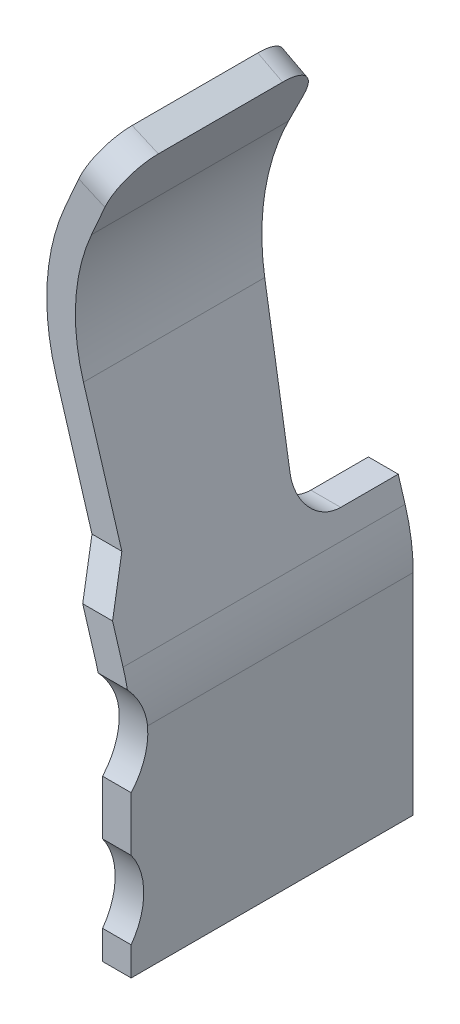
ISO-10303-21;
HEADER;
FILE_DESCRIPTION(('STEP AP214'),'2;1');
FILE_NAME('part.step','',(''),(''),'','','');
FILE_SCHEMA(('AUTOMOTIVE_DESIGN { 1 0 10303 214 1 1 1 1 }'));
ENDSEC;
DATA;
#1=APPLICATION_CONTEXT('core data for automotive mechanical design processes');
#2=APPLICATION_PROTOCOL_DEFINITION('international standard','automotive_design',2000,#1);
#3=PRODUCT_CONTEXT('',#1,'mechanical');
#4=PRODUCT('Part','Part','',(#3));
#5=PRODUCT_RELATED_PRODUCT_CATEGORY('part','',(#4));
#6=PRODUCT_DEFINITION_FORMATION('','',#4);
#7=PRODUCT_DEFINITION_CONTEXT('part definition',#1,'design');
#8=PRODUCT_DEFINITION('design','',#6,#7);
#9=PRODUCT_DEFINITION_SHAPE('','',#8);
#10=(LENGTH_UNIT() NAMED_UNIT(*) SI_UNIT(.MILLI.,.METRE.));
#11=(NAMED_UNIT(*) PLANE_ANGLE_UNIT() SI_UNIT($,.RADIAN.));
#12=(NAMED_UNIT(*) SI_UNIT($,.STERADIAN.) SOLID_ANGLE_UNIT());
#13=UNCERTAINTY_MEASURE_WITH_UNIT(LENGTH_MEASURE(1.E-05),#10,'distance_accuracy_value','');
#14=(GEOMETRIC_REPRESENTATION_CONTEXT(3) GLOBAL_UNCERTAINTY_ASSIGNED_CONTEXT((#13)) GLOBAL_UNIT_ASSIGNED_CONTEXT((#10,
#11,#12)) REPRESENTATION_CONTEXT('',''));
#15=CARTESIAN_POINT('',(0.,0.,0.));
#16=DIRECTION('',(0.,0.,1.));
#17=DIRECTION('',(1.,0.,0.));
#18=AXIS2_PLACEMENT_3D('',#15,#16,#17);
#19=CARTESIAN_POINT('',(-0.661555066818918,3.52330708865174,0.423604352914839));
#20=DIRECTION('',(0.915327071470027,-0.402711251685503,0.));
#21=DIRECTION('',(0.402711251685503,0.915327071470027,0.));
#22=AXIS2_PLACEMENT_3D('',#19,#20,#21);
#23=CYLINDRICAL_SURFACE('',#22,0.2);
#24=CARTESIAN_POINT('',(-0.661555066818916,3.52330708865174,0.423604352914839));
#25=DIRECTION('',(-0.915327071470028,0.4027112516855,0.));
#26=DIRECTION('',(0.4027112516855,0.915327071470028,0.));
#27=AXIS2_PLACEMENT_3D('',#24,#25,#26);
#28=CIRCLE('',#27,0.2);
#29=CARTESIAN_POINT('',(-0.661555066818916,3.52330708865174,0.623604352914839));
#30=VERTEX_POINT('',#29);
#31=CARTESIAN_POINT('',(-0.581012816481817,3.70637250294574,0.423604352914839));
#32=VERTEX_POINT('',#31);
#33=EDGE_CURVE('E411',#30,#32,#28,.T.);
#34=ORIENTED_EDGE('',*,*,#33,.F.);
#35=DIRECTION('',(-0.915327071470027,0.402711251685503,0.));
#36=VECTOR('',#35,1.);
#37=CARTESIAN_POINT('',(-25.2715059297135,14.3508073613119,0.623604352914805));
#38=LINE('',#37,#36);
#39=CARTESIAN_POINT('',(-0.524256006098414,3.46290040089891,0.623604352914839));
#40=VERTEX_POINT('',#39);
#41=EDGE_CURVE('E27',#40,#30,#38,.T.);
#42=ORIENTED_EDGE('',*,*,#41,.F.);
#43=CARTESIAN_POINT('',(-0.524256006098414,3.46290040089891,0.423604352914839));
#44=DIRECTION('',(0.915327071470028,-0.402711251685501,0.));
#45=DIRECTION('',(-0.402711251685501,-0.915327071470028,0.));
#46=AXIS2_PLACEMENT_3D('',#43,#44,#45);
#47=CIRCLE('',#46,0.2);
#48=CARTESIAN_POINT('',(-0.443713755761315,3.64596581519291,0.423604352914839));
#49=VERTEX_POINT('',#48);
#50=EDGE_CURVE('E578',#49,#40,#47,.T.);
#51=ORIENTED_EDGE('',*,*,#50,.F.);
#52=DIRECTION('',(0.915327071470027,-0.402711251685503,0.));
#53=VECTOR('',#52,1.);
#54=CARTESIAN_POINT('',(-0.581012816481817,3.70637250294574,0.423604352914839));
#55=LINE('',#54,#53);
#56=EDGE_CURVE('E378',#32,#49,#55,.T.);
#57=ORIENTED_EDGE('',*,*,#56,.F.);
#58=EDGE_LOOP('',(#34,#42,#51,#57));
#59=FACE_BOUND('',#58,.T.);
#60=ADVANCED_FACE('F16',(#59),#23,.T.);
#61=CARTESIAN_POINT('',(-0.683862741329987,3.53312166947706,-0.236832722369337));
#62=DIRECTION('',(-0.914255270392898,0.402239697454473,-0.0483789866630451));
#63=DIRECTION('',(-0.402711251685503,-0.915327071470027,0.));
#64=AXIS2_PLACEMENT_3D('',#61,#62,#63);
#65=CYLINDRICAL_SURFACE('',#64,0.2);
#66=CARTESIAN_POINT('',(-0.533059461954224,3.44289092405021,-0.427421697659668));
#67=CARTESIAN_POINT('',(-0.481982534807634,3.55898426375477,-0.441384710680955));
#68=CARTESIAN_POINT('',(-0.443713755761314,3.64596581519291,-0.356133634256614));
#69=CARTESIAN_POINT('',(-0.443713755761313,3.64596581519291,-0.228386927890316));
#70=(BOUNDED_CURVE() B_SPLINE_CURVE(3,(#66,#67,#68,#69),.UNSPECIFIED.,.F.,
.F.) B_SPLINE_CURVE_WITH_KNOTS((4,4),(6.17366415670651,7.85398163397443),
.UNSPECIFIED.) CURVE() GEOMETRIC_REPRESENTATION_ITEM() RATIONAL_B_SPLINE_CURVE((1.,
0.778229742533869,0.778229742533869,1.)) REPRESENTATION_ITEM(''));
#71=CARTESIAN_POINT('',(-0.533059461954224,3.44289092405021,-0.427421697659668));
#72=VERTEX_POINT('',#71);
#73=CARTESIAN_POINT('',(-0.443713755761313,3.64596581519291,-0.228386927890316));
#74=VERTEX_POINT('',#73);
#75=EDGE_CURVE('E377',#72,#74,#70,.T.);
#76=ORIENTED_EDGE('',*,*,#75,.F.);
#77=DIRECTION('',(0.914255270392898,-0.402239697454473,0.0483789866630451));
#78=VECTOR('',#77,1.);
#79=CARTESIAN_POINT('',(-25.871852655037,14.5910558161891,-1.76825633941021));
#80=LINE('',#79,#78);
#81=CARTESIAN_POINT('',(-0.670358522674724,3.50329761180303,-0.434687053017796));
#82=VERTEX_POINT('',#81);
#83=EDGE_CURVE('E11',#82,#72,#80,.T.);
#84=ORIENTED_EDGE('',*,*,#83,.F.);
#85=CARTESIAN_POINT('',(-0.581012816481815,3.70637250294574,-0.235652283248443));
#86=CARTESIAN_POINT('',(-0.581012816481817,3.70637250294574,-0.363398989614741));
#87=CARTESIAN_POINT('',(-0.619281595528137,3.6193909515076,-0.448650066039083));
#88=CARTESIAN_POINT('',(-0.670358522674724,3.50329761180303,-0.434687053017796));
#89=(BOUNDED_CURVE() B_SPLINE_CURVE(3,(#85,#86,#87,#88),.UNSPECIFIED.,.F.,
.F.) B_SPLINE_CURVE_WITH_KNOTS((4,4),(4.71238898038476,6.39270645765268),
.UNSPECIFIED.) CURVE() GEOMETRIC_REPRESENTATION_ITEM() RATIONAL_B_SPLINE_CURVE((1.,
0.77822974253387,0.77822974253387,1.)) REPRESENTATION_ITEM(''));
#90=CARTESIAN_POINT('',(-0.581012816481815,3.70637250294574,-0.235652283248443));
#91=VERTEX_POINT('',#90);
#92=EDGE_CURVE('E389',#91,#82,#89,.T.);
#93=ORIENTED_EDGE('',*,*,#92,.F.);
#94=DIRECTION('',(-0.914255270392898,0.402239697454473,-0.0483789866630451));
#95=VECTOR('',#94,1.);
#96=CARTESIAN_POINT('',(-0.603320490992886,3.71618708377106,-0.236832722369337));
#97=LINE('',#96,#95);
#98=EDGE_CURVE('E410',#74,#91,#97,.T.);
#99=ORIENTED_EDGE('',*,*,#98,.F.);
#100=EDGE_LOOP('',(#76,#84,#93,#99));
#101=FACE_BOUND('',#100,.T.);
#102=ADVANCED_FACE('F495',(#101),#65,.T.);
#103=CARTESIAN_POINT('',(-30.73,1.65634067151207,-0.212546111318104));
#104=DIRECTION('',(0.,-1.,0.));
#105=DIRECTION('',(0.,0.,-1.));
#106=AXIS2_PLACEMENT_3D('',#103,#104,#105);
#107=PLANE('',#106);
#108=DIRECTION('',(0.,0.,-1.));
#109=VECTOR('',#108,1.);
#110=CARTESIAN_POINT('',(-0.505164921058459,1.65634067151207,-0.740000000000018));
#111=LINE('',#110,#109);
#112=CARTESIAN_POINT('',(-0.505164921058459,1.65634067151207,-0.438042305987952));
#113=VERTEX_POINT('',#112);
#114=CARTESIAN_POINT('',(-0.505164921058459,1.65634067151207,-0.740000000000018));
#115=VERTEX_POINT('',#114);
#116=EDGE_CURVE('E384',#113,#115,#111,.T.);
#117=ORIENTED_EDGE('',*,*,#116,.F.);
#118=DIRECTION('',(1.,0.,0.));
#119=VECTOR('',#118,1.);
#120=CARTESIAN_POINT('',(-0.348496590894434,1.65634067151207,-0.438042305987951));
#121=LINE('',#120,#119);
#122=CARTESIAN_POINT('',(-0.34849659089442,1.65634067151207,-0.438042305987951));
#123=VERTEX_POINT('',#122);
#124=EDGE_CURVE('E420',#113,#123,#121,.T.);
#125=ORIENTED_EDGE('',*,*,#124,.T.);
#126=DIRECTION('',(0.,0.,1.));
#127=VECTOR('',#126,1.);
#128=CARTESIAN_POINT('',(-0.34849659089442,1.65634067151207,-0.740000000000018));
#129=LINE('',#128,#127);
#130=CARTESIAN_POINT('',(-0.34849659089442,1.65634067151207,-0.740000000000018));
#131=VERTEX_POINT('',#130);
#132=EDGE_CURVE('E569',#131,#123,#129,.T.);
#133=ORIENTED_EDGE('',*,*,#132,.F.);
#134=DIRECTION('',(-1.,0.,0.));
#135=VECTOR('',#134,1.);
#136=CARTESIAN_POINT('',(-1.27,1.65634067151207,-0.740000000000019));
#137=LINE('',#136,#135);
#138=EDGE_CURVE('E405',#131,#115,#137,.T.);
#139=ORIENTED_EDGE('',*,*,#138,.T.);
#140=EDGE_LOOP('',(#117,#125,#133,#139));
#141=FACE_BOUND('',#140,.T.);
#142=ADVANCED_FACE('F501',(#141),#107,.F.);
#143=CARTESIAN_POINT('',(-30.73,3.70637250294571,-0.459111687165995));
#144=DIRECTION('',(0.,0.119413416546905,0.992844618230162));
#145=DIRECTION('',(1.,0.,0.));
#146=AXIS2_PLACEMENT_3D('',#143,#144,#145);
#147=PLANE('',#146);
#148=DIRECTION('',(-0.28674853992682,0.951150986717314,-0.11439875574724));
#149=VECTOR('',#148,1.);
#150=CARTESIAN_POINT('',(-0.330336045111497,1.59610175610151,-0.205300934614502));
#151=LINE('',#150,#149);
#152=CARTESIAN_POINT('',(-0.415991692566375,1.88022335482146,-0.239473382341919));
#153=VERTEX_POINT('',#152);
#154=CARTESIAN_POINT('',(-0.63658626409634,2.61194022573825,-0.327479914176621));
#155=VERTEX_POINT('',#154);
#156=EDGE_CURVE('E437',#153,#155,#151,.T.);
#157=ORIENTED_EDGE('',*,*,#156,.F.);
#158=DIRECTION('',(-1.,0.,0.));
#159=VECTOR('',#158,1.);
#160=CARTESIAN_POINT('',(-0.505164921058468,1.88022335482146,-0.23947338234192));
#161=LINE('',#160,#159);
#162=CARTESIAN_POINT('',(-0.572660022730412,1.88022335482146,-0.23947338234192));
#163=VERTEX_POINT('',#162);
#164=EDGE_CURVE('E310',#153,#163,#161,.T.);
#165=ORIENTED_EDGE('',*,*,#164,.T.);
#166=DIRECTION('',(0.286748539926818,-0.951150986717315,0.11439875574724));
#167=VECTOR('',#166,1.);
#168=CARTESIAN_POINT('',(-0.474122364888061,1.55337185451571,-0.200161637444145));
#169=LINE('',#168,#167);
#170=CARTESIAN_POINT('',(-0.780201760453783,2.56864369924933,-0.322272466749579));
#171=VERTEX_POINT('',#170);
#172=EDGE_CURVE('E450',#171,#163,#169,.T.);
#173=ORIENTED_EDGE('',*,*,#172,.F.);
#174=CARTESIAN_POINT('',(-0.731775753903917,3.36370167510267,-0.417897288102545));
#175=CARTESIAN_POINT('',(-0.843300794906729,3.11021511680704,-0.387409439934768));
#176=CARTESIAN_POINT('',(-0.860137394596042,2.83379189253285,-0.354162906673266));
#177=CARTESIAN_POINT('',(-0.780201760453783,2.56864369924933,-0.322272466749579));
#178=(BOUNDED_CURVE() B_SPLINE_CURVE(3,(#174,#175,#176,#177),.UNSPECIFIED.,.F.,
.F.) B_SPLINE_CURVE_WITH_KNOTS((4,4),(4.29791199977039,5.00519872138853),
.UNSPECIFIED.) CURVE() GEOMETRIC_REPRESENTATION_ITEM() RATIONAL_B_SPLINE_CURVE((1.,
0.958744787021091,0.958744787021091,1.)) REPRESENTATION_ITEM(''));
#179=CARTESIAN_POINT('',(-0.731775753903917,3.36370167510267,-0.417897288102545));
#180=VERTEX_POINT('',#179);
#181=EDGE_CURVE('E460',#180,#171,#178,.T.);
#182=ORIENTED_EDGE('',*,*,#181,.F.);
#183=DIRECTION('',(-0.400292818236851,-0.909830186054405,0.109428936813832));
#184=VECTOR('',#183,1.);
#185=CARTESIAN_POINT('',(-0.71766648991178,3.39577078475993,-0.421754368938234));
#186=LINE('',#185,#184);
#187=EDGE_CURVE('E395',#82,#180,#186,.T.);
#188=ORIENTED_EDGE('',*,*,#187,.F.);
#189=ORIENTED_EDGE('',*,*,#83,.T.);
#190=DIRECTION('',(0.400292818236852,0.909830186054405,-0.109428936813832));
#191=VECTOR('',#190,1.);
#192=CARTESIAN_POINT('',(-0.580049180344069,3.33608744850051,-0.414576013974332));
#193=LINE('',#192,#191);
#194=CARTESIAN_POINT('',(-0.594476693183414,3.30329498734983,-0.410631932744417));
#195=VERTEX_POINT('',#194);
#196=EDGE_CURVE('E373',#195,#72,#193,.T.);
#197=ORIENTED_EDGE('',*,*,#196,.F.);
#198=CARTESIAN_POINT('',(-0.63658626409634,2.61194022573825,-0.327479914176621));
#199=CARTESIAN_POINT('',(-0.706095511176566,2.84250387207174,-0.355210731501565));
#200=CARTESIAN_POINT('',(-0.691454989707598,3.08287189317973,-0.384120760424611));
#201=CARTESIAN_POINT('',(-0.594476693183414,3.30329498734983,-0.410631932744417));
#202=(BOUNDED_CURVE() B_SPLINE_CURVE(3,(#198,#199,#200,#201),.UNSPECIFIED.,.F.,
.F.) B_SPLINE_CURVE_WITH_KNOTS((4,4),(1.27798658579106,1.98527330740919),
.UNSPECIFIED.) CURVE() GEOMETRIC_REPRESENTATION_ITEM() RATIONAL_B_SPLINE_CURVE((1.,
0.958744787021091,0.958744787021091,1.)) REPRESENTATION_ITEM(''));
#203=EDGE_CURVE('E357',#155,#195,#202,.T.);
#204=ORIENTED_EDGE('',*,*,#203,.F.);
#205=EDGE_LOOP('',(#157,#165,#173,#182,#188,#189,#197,#204));
#206=FACE_BOUND('',#205,.T.);
#207=ADVANCED_FACE('F511',(#206),#147,.F.);
#208=CARTESIAN_POINT('',(-30.73,1.94413292378283,0.623604352914797));
#209=DIRECTION('',(0.,0.,-1.));
#210=DIRECTION('',(0.,-1.,0.));
#211=AXIS2_PLACEMENT_3D('',#208,#209,#210);
#212=PLANE('',#211);
#213=DIRECTION('',(-0.402711251685501,-0.915327071470028,0.));
#214=VECTOR('',#213,1.);
#215=CARTESIAN_POINT('',(-0.594476693183417,3.30329498734984,0.623604352914839));
#216=LINE('',#215,#214);
#217=CARTESIAN_POINT('',(-0.594476693183415,3.30329498734984,0.623604352914839));
#218=VERTEX_POINT('',#217);
#219=EDGE_CURVE('E388',#40,#218,#216,.T.);
#220=ORIENTED_EDGE('',*,*,#219,.F.);
#221=ORIENTED_EDGE('',*,*,#41,.T.);
#222=DIRECTION('',(0.4027112516855,0.915327071470028,0.));
#223=VECTOR('',#222,1.);
#224=CARTESIAN_POINT('',(-0.731775753903919,3.36370167510267,0.623604352914839));
#225=LINE('',#224,#223);
#226=CARTESIAN_POINT('',(-0.731775753903919,3.36370167510267,0.623604352914839));
#227=VERTEX_POINT('',#226);
#228=EDGE_CURVE('E427',#227,#30,#225,.T.);
#229=ORIENTED_EDGE('',*,*,#228,.F.);
#230=CARTESIAN_POINT('',(0.320850378286613,2.90058373566433,0.62360435291484));
#231=DIRECTION('',(0.,0.,-1.));
#232=DIRECTION('',(-1.,0.,0.));
#233=AXIS2_PLACEMENT_3D('',#230,#231,#232);
#234=CIRCLE('',#233,1.15);
#235=CARTESIAN_POINT('',(-0.780201760453785,2.56864369924933,0.623604352914839));
#236=VERTEX_POINT('',#235);
#237=EDGE_CURVE('E465',#236,#227,#234,.T.);
#238=ORIENTED_EDGE('',*,*,#237,.F.);
#239=DIRECTION('',(-0.288643509926088,0.957436642382956,0.));
#240=VECTOR('',#239,1.);
#241=CARTESIAN_POINT('',(-0.456178853974488,1.49385284836845,0.623604352914839));
#242=LINE('',#241,#240);
#243=CARTESIAN_POINT('',(-0.59192717993568,1.94413292378283,0.623604352914839));
#244=VERTEX_POINT('',#243);
#245=EDGE_CURVE('E548',#244,#236,#242,.T.);
#246=ORIENTED_EDGE('',*,*,#245,.F.);
#247=DIRECTION('',(1.,0.,0.));
#248=VECTOR('',#247,1.);
#249=CARTESIAN_POINT('',(-30.73,1.94413292378283,0.623604352914797));
#250=LINE('',#249,#248);
#251=CARTESIAN_POINT('',(-0.435258849771643,1.94413292378283,0.623604352914839));
#252=VERTEX_POINT('',#251);
#253=EDGE_CURVE('E403',#244,#252,#250,.T.);
#254=ORIENTED_EDGE('',*,*,#253,.T.);
#255=DIRECTION('',(0.28864350992609,-0.957436642382956,0.));
#256=VECTOR('',#255,1.);
#257=CARTESIAN_POINT('',(-0.312563357617044,1.53714937485737,0.623604352914839));
#258=LINE('',#257,#256);
#259=CARTESIAN_POINT('',(-0.636586264096342,2.61194022573825,0.623604352914839));
#260=VERTEX_POINT('',#259);
#261=EDGE_CURVE('E415',#260,#252,#258,.T.);
#262=ORIENTED_EDGE('',*,*,#261,.F.);
#263=CARTESIAN_POINT('',(0.320850378286613,2.90058373566433,0.62360435291484));
#264=DIRECTION('',(0.,0.,1.));
#265=DIRECTION('',(-1.,0.,0.));
#266=AXIS2_PLACEMENT_3D('',#263,#264,#265);
#267=CIRCLE('',#266,1.);
#268=EDGE_CURVE('E577',#218,#260,#267,.T.);
#269=ORIENTED_EDGE('',*,*,#268,.F.);
#270=EDGE_LOOP('',(#220,#221,#229,#238,#246,#254,#262,#269));
#271=FACE_BOUND('',#270,.T.);
#272=ADVANCED_FACE('F513',(#271),#212,.F.);
#273=CARTESIAN_POINT('',(-30.73,1.7003498353216,0.749999999999972));
#274=DIRECTION('',(0.,-0.460287319631494,-0.887770005906065));
#275=DIRECTION('',(0.,-0.887770005906065,0.460287319631494));
#276=AXIS2_PLACEMENT_3D('',#273,#274,#275);
#277=PLANE('',#276);
#278=DIRECTION('',(-1.,0.,0.));
#279=VECTOR('',#278,1.);
#280=CARTESIAN_POINT('',(-1.27,1.7196371362757,0.739999999999981));
#281=LINE('',#280,#279);
#282=CARTESIAN_POINT('',(-0.36757891232074,1.7196371362757,0.739999999999982));
#283=VERTEX_POINT('',#282);
#284=CARTESIAN_POINT('',(-0.524247242484777,1.7196371362757,0.739999999999982));
#285=VERTEX_POINT('',#284);
#286=EDGE_CURVE('E326',#283,#285,#281,.T.);
#287=ORIENTED_EDGE('',*,*,#286,.F.);
#288=DIRECTION('',(0.258541028225372,-0.857586072334425,0.444637678635293));
#289=VECTOR('',#288,1.);
#290=CARTESIAN_POINT('',(-0.493576561693567,2.13757401070795,0.523309818502748));
#291=LINE('',#290,#289);
#292=EDGE_CURVE('E412',#252,#283,#291,.T.);
#293=ORIENTED_EDGE('',*,*,#292,.F.);
#294=ORIENTED_EDGE('',*,*,#253,.F.);
#295=DIRECTION('',(-0.258541028225371,0.857586072334425,-0.444637678635293));
#296=VECTOR('',#295,1.);
#297=CARTESIAN_POINT('',(-0.639772638083798,2.10283732290249,0.541319952677684));
#298=LINE('',#297,#296);
#299=EDGE_CURVE('E383',#285,#244,#298,.T.);
#300=ORIENTED_EDGE('',*,*,#299,.F.);
#301=EDGE_LOOP('',(#287,#293,#294,#300));
#302=FACE_BOUND('',#301,.T.);
#303=ADVANCED_FACE('F651',(#302),#277,.F.);
#304=CARTESIAN_POINT('',(-1.27,1.24850586493128,0.739999999999981));
#305=DIRECTION('',(0.,0.,-1.));
#306=DIRECTION('',(0.,-1.,0.));
#307=AXIS2_PLACEMENT_3D('',#304,#305,#306);
#308=PLANE('',#307);
#309=DIRECTION('',(0.,-1.,0.));
#310=VECTOR('',#309,1.);
#311=CARTESIAN_POINT('',(-0.27,0.145965815192914,0.739999999999982));
#312=LINE('',#311,#310);
#313=CARTESIAN_POINT('',(-0.270000000000005,0.296740599868486,0.739999999999982));
#314=VERTEX_POINT('',#313);
#315=CARTESIAN_POINT('',(-0.27,0.145965815192914,0.739999999999982));
#316=VERTEX_POINT('',#315);
#317=EDGE_CURVE('E459',#314,#316,#312,.T.);
#318=ORIENTED_EDGE('',*,*,#317,.F.);
#319=DIRECTION('',(-1.,0.,0.));
#320=VECTOR('',#319,1.);
#321=CARTESIAN_POINT('',(-30.73,0.296740599868486,0.73999999999994));
#322=LINE('',#321,#320);
#323=CARTESIAN_POINT('',(-0.42,0.296740599868486,0.739999999999982));
#324=VERTEX_POINT('',#323);
#325=EDGE_CURVE('E347',#314,#324,#322,.T.);
#326=ORIENTED_EDGE('',*,*,#325,.T.);
#327=DIRECTION('',(0.,1.,0.));
#328=VECTOR('',#327,1.);
#329=CARTESIAN_POINT('',(-0.42,0.145965815192914,0.739999999999982));
#330=LINE('',#329,#328);
#331=CARTESIAN_POINT('',(-0.42,0.145965815192914,0.739999999999982));
#332=VERTEX_POINT('',#331);
#333=EDGE_CURVE('E372',#332,#324,#330,.T.);
#334=ORIENTED_EDGE('',*,*,#333,.F.);
#335=DIRECTION('',(-1.,0.,0.));
#336=VECTOR('',#335,1.);
#337=CARTESIAN_POINT('',(-0.42,0.145965815192914,0.739999999999982));
#338=LINE('',#337,#336);
#339=EDGE_CURVE('E341',#316,#332,#338,.T.);
#340=ORIENTED_EDGE('',*,*,#339,.F.);
#341=EDGE_LOOP('',(#318,#326,#334,#340));
#342=FACE_BOUND('',#341,.T.);
#343=ADVANCED_FACE('F649',(#342),#308,.F.);
#344=CARTESIAN_POINT('',(-1.27,1.24850586493128,-0.740000000000019));
#345=DIRECTION('',(0.,0.,-1.));
#346=DIRECTION('',(0.,-1.,0.));
#347=AXIS2_PLACEMENT_3D('',#344,#345,#346);
#348=PLANE('',#347);
#349=ORIENTED_EDGE('',*,*,#138,.F.);
#350=DIRECTION('',(0.28864350992609,-0.957436642382956,0.));
#351=VECTOR('',#350,1.);
#352=CARTESIAN_POINT('',(-0.312563357617042,1.53714937485737,-0.740000000000018));
#353=LINE('',#352,#351);
#354=CARTESIAN_POINT('',(-0.312563357617044,1.53714937485737,-0.740000000000018));
#355=VERTEX_POINT('',#354);
#356=EDGE_CURVE('E573',#131,#355,#353,.T.);
#357=ORIENTED_EDGE('',*,*,#356,.T.);
#358=CARTESIAN_POINT('',(-1.27,1.24850586493128,-0.740000000000019));
#359=DIRECTION('',(0.,0.,-1.));
#360=DIRECTION('',(-1.,0.,0.));
#361=AXIS2_PLACEMENT_3D('',#358,#359,#360);
#362=CIRCLE('',#361,1.);
#363=CARTESIAN_POINT('',(-0.27,1.24850586493128,-0.740000000000018));
#364=VERTEX_POINT('',#363);
#365=EDGE_CURVE('E572',#355,#364,#362,.T.);
#366=ORIENTED_EDGE('',*,*,#365,.T.);
#367=DIRECTION('',(0.,-1.,0.));
#368=VECTOR('',#367,1.);
#369=CARTESIAN_POINT('',(-0.27,0.145965815192914,-0.740000000000018));
#370=LINE('',#369,#368);
#371=CARTESIAN_POINT('',(-0.27,0.145965815192914,-0.740000000000018));
#372=VERTEX_POINT('',#371);
#373=EDGE_CURVE('E41',#364,#372,#370,.T.);
#374=ORIENTED_EDGE('',*,*,#373,.T.);
#375=DIRECTION('',(-1.,0.,0.));
#376=VECTOR('',#375,1.);
#377=CARTESIAN_POINT('',(-0.42,0.145965815192914,-0.740000000000018));
#378=LINE('',#377,#376);
#379=CARTESIAN_POINT('',(-0.42,0.145965815192914,-0.740000000000018));
#380=VERTEX_POINT('',#379);
#381=EDGE_CURVE('E339',#372,#380,#378,.T.);
#382=ORIENTED_EDGE('',*,*,#381,.T.);
#383=DIRECTION('',(0.,1.,0.));
#384=VECTOR('',#383,1.);
#385=CARTESIAN_POINT('',(-0.42,0.145965815192914,-0.740000000000018));
#386=LINE('',#385,#384);
#387=CARTESIAN_POINT('',(-0.42,1.24850586493128,-0.740000000000018));
#388=VERTEX_POINT('',#387);
#389=EDGE_CURVE('E301',#380,#388,#386,.T.);
#390=ORIENTED_EDGE('',*,*,#389,.T.);
#391=CARTESIAN_POINT('',(-1.27,1.24850586493128,-0.740000000000019));
#392=DIRECTION('',(0.,0.,1.));
#393=DIRECTION('',(-1.,0.,0.));
#394=AXIS2_PLACEMENT_3D('',#391,#392,#393);
#395=CIRCLE('',#394,0.85);
#396=CARTESIAN_POINT('',(-0.456178853974486,1.49385284836845,-0.740000000000018));
#397=VERTEX_POINT('',#396);
#398=EDGE_CURVE('E456',#388,#397,#395,.T.);
#399=ORIENTED_EDGE('',*,*,#398,.T.);
#400=DIRECTION('',(-0.288643509926088,0.957436642382956,0.));
#401=VECTOR('',#400,1.);
#402=CARTESIAN_POINT('',(-0.456178853974486,1.49385284836845,-0.740000000000018));
#403=LINE('',#402,#401);
#404=EDGE_CURVE('E379',#397,#115,#403,.T.);
#405=ORIENTED_EDGE('',*,*,#404,.T.);
#406=EDGE_LOOP('',(#349,#357,#366,#374,#382,#390,#399,#405));
#407=FACE_BOUND('',#406,.T.);
#408=ADVANCED_FACE('F640',(#407),#348,.T.);
#409=CARTESIAN_POINT('',(-0.27,0.145965815192914,-0.740000000000018));
#410=DIRECTION('',(-1.,0.,0.));
#411=DIRECTION('',(0.,0.,1.));
#412=AXIS2_PLACEMENT_3D('',#409,#410,#411);
#413=PLANE('',#412);
#414=DIRECTION('',(0.,0.,1.));
#415=VECTOR('',#414,1.);
#416=CARTESIAN_POINT('',(-0.27,1.24850586493128,-0.740000000000018));
#417=LINE('',#416,#415);
#418=CARTESIAN_POINT('',(-0.270000000000005,1.24850586493128,0.654029100989327));
#419=VERTEX_POINT('',#418);
#420=EDGE_CURVE('E529',#364,#419,#417,.T.);
#421=ORIENTED_EDGE('',*,*,#420,.T.);
#422=CARTESIAN_POINT('',(-0.270000000000005,1.21669179396546,0.995153761033099));
#423=DIRECTION('',(1.,0.,0.));
#424=DIRECTION('',(0.,0.,1.));
#425=AXIS2_PLACEMENT_3D('',#422,#423,#424);
#426=CIRCLE('',#425,0.342604974863759);
#427=CARTESIAN_POINT('',(-0.270000000000005,0.988055123608201,0.739999999999982));
#428=VERTEX_POINT('',#427);
#429=EDGE_CURVE('E261',#428,#419,#426,.T.);
#430=ORIENTED_EDGE('',*,*,#429,.F.);
#431=DIRECTION('',(0.,-1.,0.));
#432=VECTOR('',#431,1.);
#433=CARTESIAN_POINT('',(-0.27,0.145965815192914,0.739999999999982));
#434=LINE('',#433,#432);
#435=CARTESIAN_POINT('',(-0.270000000000005,0.703259400131467,0.739999999999982));
#436=VERTEX_POINT('',#435);
#437=EDGE_CURVE('E242',#428,#436,#434,.T.);
#438=ORIENTED_EDGE('',*,*,#437,.T.);
#439=CARTESIAN_POINT('',(-0.270000000000005,0.499999999999977,1.01942683457021));
#440=DIRECTION('',(1.,0.,0.));
#441=DIRECTION('',(0.,0.,1.));
#442=AXIS2_PLACEMENT_3D('',#439,#440,#441);
#443=CIRCLE('',#442,0.345533991988848);
#444=EDGE_CURVE('E351',#314,#436,#443,.T.);
#445=ORIENTED_EDGE('',*,*,#444,.F.);
#446=ORIENTED_EDGE('',*,*,#317,.T.);
#447=DIRECTION('',(0.,0.,1.));
#448=VECTOR('',#447,1.);
#449=CARTESIAN_POINT('',(-0.27,0.145965815192914,-0.740000000000018));
#450=LINE('',#449,#448);
#451=EDGE_CURVE('E302',#372,#316,#450,.T.);
#452=ORIENTED_EDGE('',*,*,#451,.F.);
#453=ORIENTED_EDGE('',*,*,#373,.F.);
#454=EDGE_LOOP('',(#421,#430,#438,#445,#446,#452,#453));
#455=FACE_BOUND('',#454,.T.);
#456=ADVANCED_FACE('F284',(#455),#413,.F.);
#457=CARTESIAN_POINT('',(-1.27,1.24850586493128,-0.740000000000019));
#458=DIRECTION('',(0.,0.,1.));
#459=DIRECTION('',(1.,0.,0.));
#460=AXIS2_PLACEMENT_3D('',#457,#458,#459);
#461=CYLINDRICAL_SURFACE('',#460,1.);
#462=CARTESIAN_POINT('',(-1.27,1.24850586493128,0.739999999999981));
#463=DIRECTION('',(0.,0.,-1.));
#464=DIRECTION('',(-1.,0.,0.));
#465=AXIS2_PLACEMENT_3D('',#462,#463,#464);
#466=CIRCLE('',#465,1.);
#467=CARTESIAN_POINT('',(-0.312563357617045,1.53714937485737,0.739999999999982));
#468=VERTEX_POINT('',#467);
#469=CARTESIAN_POINT('',(-0.289560881865275,1.44532846432271,0.739999999999982));
#470=VERTEX_POINT('',#469);
#471=EDGE_CURVE('E228',#468,#470,#466,.T.);
#472=ORIENTED_EDGE('',*,*,#471,.T.);
#473=CARTESIAN_POINT('',(-0.289560881865276,1.44532846432271,0.739999999999982));
#474=CARTESIAN_POINT('',(-0.288878682583164,1.4419302471742,0.73695469854553));
#475=CARTESIAN_POINT('',(-0.288202781491508,1.43847176034271,0.733975045899739));
#476=CARTESIAN_POINT('',(-0.286871440474027,1.43145643098173,0.728168909339999));
#477=CARTESIAN_POINT('',(-0.286215910683777,1.4279002110217,0.725341693611933));
#478=CARTESIAN_POINT('',(-0.284928311830287,1.42068928784964,0.719840380711266));
#479=CARTESIAN_POINT('',(-0.284296161720783,1.41703501951599,0.717165732805619));
#480=CARTESIAN_POINT('',(-0.283058427873437,1.40962817005629,0.711969336935426));
#481=CARTESIAN_POINT('',(-0.282452784478732,1.40587584366131,0.709447240161887));
#482=CARTESIAN_POINT('',(-0.281271228703156,1.39827302810716,0.704555749407427));
#483=CARTESIAN_POINT('',(-0.280695291111547,1.39442262647144,0.702186225502017));
#484=CARTESIAN_POINT('',(-0.279576382774034,1.38662388081515,0.697599649617423));
#485=CARTESIAN_POINT('',(-0.279033434183224,1.38267547342769,0.695382699975889));
#486=CARTESIAN_POINT('',(-0.27798380395006,1.37468096295907,0.691101059928249));
#487=CARTESIAN_POINT('',(-0.277477204261149,1.37063466501779,0.689036713287359));
#488=CARTESIAN_POINT('',(-0.276503648406026,1.36244473872741,0.68505995514894));
#489=CARTESIAN_POINT('',(-0.276036845603953,1.35830080604152,0.683148133100331));
#490=CARTESIAN_POINT('',(-0.275146148982741,1.34991442649092,0.679475891500464));
#491=CARTESIAN_POINT('',(-0.274722504928995,1.34567156354334,0.677716361222175));
#492=CARTESIAN_POINT('',(-0.273926471942081,1.33713872195234,0.67437603386879));
#493=CARTESIAN_POINT('',(-0.27355381064899,1.33284913740293,0.672794295796545));
#494=CARTESIAN_POINT('',(-0.272861361452102,1.32422362544513,0.669809238507272));
#495=CARTESIAN_POINT('',(-0.272541365850075,1.31988795555454,0.668405223722643));
#496=CARTESIAN_POINT('',(-0.271955855889899,1.31117101253282,0.665775382478383));
#497=CARTESIAN_POINT('',(-0.271690208575333,1.30678987892417,0.664549123358667));
#498=CARTESIAN_POINT('',(-0.271215006321554,1.29798278695432,0.662274523841798));
#499=CARTESIAN_POINT('',(-0.271005402039289,1.29355687160879,0.661226027233404));
#500=CARTESIAN_POINT('',(-0.270643887759249,1.28466100981404,0.659306657193431));
#501=CARTESIAN_POINT('',(-0.270492019451184,1.2801910339301,0.658435912321234));
#502=CARTESIAN_POINT('',(-0.27024760848128,1.27120787033449,0.656871822149803));
#503=CARTESIAN_POINT('',(-0.270155204298726,1.2666946064207,0.656178893183976));
#504=CARTESIAN_POINT('',(-0.270031243623934,1.25762568522588,0.654969909316697));
#505=CARTESIAN_POINT('',(-0.269999925877989,1.2530699312534,0.654454554866675));
#506=CARTESIAN_POINT('',(-0.270000000000002,1.24850586493128,0.654029100989326));
#507=B_SPLINE_CURVE_WITH_KNOTS('',3,(#473,#474,#475,#476,#477,#478,#479,#480,#481,#482,#483,
#484,#485,#486,#487,#488,#489,#490,#491,#492,#493,#494,#495,#496,#497,#498,#499,#500,#501,#502,
#503,#504,#505,#506),.UNSPECIFIED.,.F.,.F.,(4,2,2,2,2,2,2,2,2,2,2,2,2,2,2,2,4),(0.,
0.0138407212060806,0.0276076629968661,0.0413212735158607,0.0550022400250798,0.0686713979827876,
0.0823496367918205,0.0960578043228291,0.109816612381096,0.123650992268955,0.13740831096958,
0.151110002599385,0.164777762982645,0.178433449670149,0.192098978145328,0.205796216649424,
0.219546882133365),.UNSPECIFIED.);
#508=EDGE_CURVE('E233',#470,#419,#507,.T.);
#509=ORIENTED_EDGE('',*,*,#508,.T.);
#510=ORIENTED_EDGE('',*,*,#420,.F.);
#511=ORIENTED_EDGE('',*,*,#365,.F.);
#512=DIRECTION('',(0.,0.,1.));
#513=VECTOR('',#512,1.);
#514=CARTESIAN_POINT('',(-0.312563357617044,1.53714937485737,-0.740000000000018));
#515=LINE('',#514,#513);
#516=EDGE_CURVE('E237',#355,#468,#515,.T.);
#517=ORIENTED_EDGE('',*,*,#516,.T.);
#518=EDGE_LOOP('',(#472,#509,#510,#511,#517));
#519=FACE_BOUND('',#518,.T.);
#520=ADVANCED_FACE('F230',(#519),#461,.T.);
#521=CARTESIAN_POINT('',(-0.312563357617042,1.53714937485737,-0.740000000000018));
#522=DIRECTION('',(-0.957436642382956,-0.28864350992609,0.));
#523=DIRECTION('',(-0.28864350992609,0.957436642382956,0.));
#524=AXIS2_PLACEMENT_3D('',#521,#522,#523);
#525=PLANE('',#524);
#526=ORIENTED_EDGE('',*,*,#356,.F.);
#527=ORIENTED_EDGE('',*,*,#132,.T.);
#528=CARTESIAN_POINT('',(-0.34849659089442,1.65634067151207,-0.438042305987951));
#529=CARTESIAN_POINT('',(-0.34849659089442,1.65634067151208,-0.320885018462571));
#530=CARTESIAN_POINT('',(-0.373471623436477,1.73918338398669,-0.238042305987951));
#531=CARTESIAN_POINT('',(-0.408791653178163,1.85634067151208,-0.238042305987952));
#532=(BOUNDED_CURVE() B_SPLINE_CURVE(3,(#528,#529,#530,#531),.UNSPECIFIED.,.F.,
.F.) B_SPLINE_CURVE_WITH_KNOTS((4,4),(3.1415926535898,4.71238898038469),
.UNSPECIFIED.) CURVE() GEOMETRIC_REPRESENTATION_ITEM() RATIONAL_B_SPLINE_CURVE((1.,
0.804737854124365,0.804737854124365,1.)) REPRESENTATION_ITEM(''));
#533=CARTESIAN_POINT('',(-0.408791653178163,1.85634067151208,-0.238042305987952));
#534=VERTEX_POINT('',#533);
#535=EDGE_CURVE('E364',#123,#534,#532,.T.);
#536=ORIENTED_EDGE('',*,*,#535,.T.);
#537=CARTESIAN_POINT('',(-0.408791653178163,1.85634067151208,-0.238042305987952));
#538=CARTESIAN_POINT('',(-0.411198844415481,1.86432537588468,-0.238042305987952));
#539=CARTESIAN_POINT('',(-0.413601725701352,1.87229578405696,-0.23851990151267));
#540=CARTESIAN_POINT('',(-0.415991692566375,1.88022335482146,-0.239473382341919));
#541=(BOUNDED_CURVE() B_SPLINE_CURVE(3,(#537,#538,#539,#540),.UNSPECIFIED.,.F.,
.F.) B_SPLINE_CURVE_WITH_KNOTS((4,4),(4.71238898038469,4.83208803082147),
.UNSPECIFIED.) CURVE() GEOMETRIC_REPRESENTATION_ITEM() RATIONAL_B_SPLINE_CURVE((1.,
0.998806367803328,0.998806367803328,1.)) REPRESENTATION_ITEM(''));
#542=EDGE_CURVE('E359',#534,#153,#541,.T.);
#543=ORIENTED_EDGE('',*,*,#542,.T.);
#544=ORIENTED_EDGE('',*,*,#156,.T.);
#545=DIRECTION('',(0.,0.,1.));
#546=VECTOR('',#545,1.);
#547=CARTESIAN_POINT('',(-0.63658626409634,2.61194022573825,-0.740000000000018));
#548=LINE('',#547,#546);
#549=EDGE_CURVE('E353',#155,#260,#548,.T.);
#550=ORIENTED_EDGE('',*,*,#549,.T.);
#551=ORIENTED_EDGE('',*,*,#261,.T.);
#552=ORIENTED_EDGE('',*,*,#292,.T.);
#553=DIRECTION('',(0.28864350992609,-0.957436642382956,0.));
#554=VECTOR('',#553,1.);
#555=CARTESIAN_POINT('',(-0.312563357617044,1.53714937485737,0.739999999999982));
#556=LINE('',#555,#554);
#557=EDGE_CURVE('E335',#283,#468,#556,.T.);
#558=ORIENTED_EDGE('',*,*,#557,.T.);
#559=ORIENTED_EDGE('',*,*,#516,.F.);
#560=EDGE_LOOP('',(#526,#527,#536,#543,#544,#550,#551,#552,#558,#559));
#561=FACE_BOUND('',#560,.T.);
#562=ADVANCED_FACE('F709',(#561),#525,.F.);
#563=CARTESIAN_POINT('',(0.320850378286615,2.90058373566433,-0.740000000000017));
#564=DIRECTION('',(0.,0.,1.));
#565=DIRECTION('',(1.,0.,0.));
#566=AXIS2_PLACEMENT_3D('',#563,#564,#565);
#567=CYLINDRICAL_SURFACE('',#566,1.);
#568=ORIENTED_EDGE('',*,*,#549,.F.);
#569=ORIENTED_EDGE('',*,*,#203,.T.);
#570=DIRECTION('',(0.,0.,1.));
#571=VECTOR('',#570,1.);
#572=CARTESIAN_POINT('',(-0.594476693183414,3.30329498734983,-0.740000000000018));
#573=LINE('',#572,#571);
#574=EDGE_CURVE('E358',#195,#218,#573,.T.);
#575=ORIENTED_EDGE('',*,*,#574,.T.);
#576=ORIENTED_EDGE('',*,*,#268,.T.);
#577=EDGE_LOOP('',(#568,#569,#575,#576));
#578=FACE_BOUND('',#577,.T.);
#579=ADVANCED_FACE('F18',(#578),#567,.F.);
#580=CARTESIAN_POINT('',(-0.594476693183415,3.30329498734984,-0.740000000000018));
#581=DIRECTION('',(-0.915327071470028,0.402711251685501,0.));
#582=DIRECTION('',(0.,0.,1.));
#583=AXIS2_PLACEMENT_3D('',#580,#581,#582);
#584=PLANE('',#583);
#585=ORIENTED_EDGE('',*,*,#196,.T.);
#586=ORIENTED_EDGE('',*,*,#75,.T.);
#587=DIRECTION('',(0.,0.,1.));
#588=VECTOR('',#587,1.);
#589=CARTESIAN_POINT('',(-0.443713755761313,3.64596581519291,-0.740000000000018));
#590=LINE('',#589,#588);
#591=EDGE_CURVE('E406',#74,#49,#590,.T.);
#592=ORIENTED_EDGE('',*,*,#591,.T.);
#593=ORIENTED_EDGE('',*,*,#50,.T.);
#594=ORIENTED_EDGE('',*,*,#219,.T.);
#595=ORIENTED_EDGE('',*,*,#574,.F.);
#596=EDGE_LOOP('',(#585,#586,#592,#593,#594,#595));
#597=FACE_BOUND('',#596,.T.);
#598=ADVANCED_FACE('F694',(#597),#584,.F.);
#599=CARTESIAN_POINT('',(-0.581012816481815,3.70637250294574,-0.740000000000018));
#600=DIRECTION('',(-0.402711251685503,-0.915327071470027,0.));
#601=DIRECTION('',(-0.915327071470027,0.402711251685503,0.));
#602=AXIS2_PLACEMENT_3D('',#599,#600,#601);
#603=PLANE('',#602);
#604=ORIENTED_EDGE('',*,*,#591,.F.);
#605=ORIENTED_EDGE('',*,*,#98,.T.);
#606=DIRECTION('',(0.,0.,1.));
#607=VECTOR('',#606,1.);
#608=CARTESIAN_POINT('',(-0.581012816481815,3.70637250294574,-0.740000000000018));
#609=LINE('',#608,#607);
#610=EDGE_CURVE('E396',#91,#32,#609,.T.);
#611=ORIENTED_EDGE('',*,*,#610,.T.);
#612=ORIENTED_EDGE('',*,*,#56,.T.);
#613=EDGE_LOOP('',(#604,#605,#611,#612));
#614=FACE_BOUND('',#613,.T.);
#615=ADVANCED_FACE('F689',(#614),#603,.F.);
#616=CARTESIAN_POINT('',(-0.731775753903917,3.36370167510267,-0.740000000000018));
#617=DIRECTION('',(0.915327071470028,-0.4027112516855,0.));
#618=DIRECTION('',(0.,0.,-1.));
#619=AXIS2_PLACEMENT_3D('',#616,#617,#618);
#620=PLANE('',#619);
#621=ORIENTED_EDGE('',*,*,#610,.F.);
#622=ORIENTED_EDGE('',*,*,#92,.T.);
#623=ORIENTED_EDGE('',*,*,#187,.T.);
#624=DIRECTION('',(0.,0.,1.));
#625=VECTOR('',#624,1.);
#626=CARTESIAN_POINT('',(-0.731775753903917,3.36370167510267,-0.740000000000018));
#627=LINE('',#626,#625);
#628=EDGE_CURVE('E466',#180,#227,#627,.T.);
#629=ORIENTED_EDGE('',*,*,#628,.T.);
#630=ORIENTED_EDGE('',*,*,#228,.T.);
#631=ORIENTED_EDGE('',*,*,#33,.T.);
#632=EDGE_LOOP('',(#621,#622,#623,#629,#630,#631));
#633=FACE_BOUND('',#632,.T.);
#634=ADVANCED_FACE('F484',(#633),#620,.F.);
#635=CARTESIAN_POINT('',(0.320850378286615,2.90058373566433,-0.740000000000017));
#636=DIRECTION('',(0.,0.,1.));
#637=DIRECTION('',(1.,0.,0.));
#638=AXIS2_PLACEMENT_3D('',#635,#636,#637);
#639=CYLINDRICAL_SURFACE('',#638,1.15);
#640=ORIENTED_EDGE('',*,*,#628,.F.);
#641=ORIENTED_EDGE('',*,*,#181,.T.);
#642=DIRECTION('',(0.,0.,1.));
#643=VECTOR('',#642,1.);
#644=CARTESIAN_POINT('',(-0.780201760453783,2.56864369924933,-0.740000000000019));
#645=LINE('',#644,#643);
#646=EDGE_CURVE('E540',#171,#236,#645,.T.);
#647=ORIENTED_EDGE('',*,*,#646,.T.);
#648=ORIENTED_EDGE('',*,*,#237,.T.);
#649=EDGE_LOOP('',(#640,#641,#647,#648));
#650=FACE_BOUND('',#649,.T.);
#651=ADVANCED_FACE('F487',(#650),#639,.T.);
#652=CARTESIAN_POINT('',(-0.456178853974486,1.49385284836845,-0.740000000000018));
#653=DIRECTION('',(0.957436642382956,0.288643509926088,0.));
#654=DIRECTION('',(0.,0.,-1.));
#655=AXIS2_PLACEMENT_3D('',#652,#653,#654);
#656=PLANE('',#655);
#657=ORIENTED_EDGE('',*,*,#172,.T.);
#658=CARTESIAN_POINT('',(-0.572660022730412,1.88022335482146,-0.23947338234192));
#659=CARTESIAN_POINT('',(-0.570270055865389,1.87229578405696,-0.23851990151267));
#660=CARTESIAN_POINT('',(-0.567867174579518,1.86432537588468,-0.238042305987952));
#661=CARTESIAN_POINT('',(-0.5654599833422,1.85634067151208,-0.238042305987952));
#662=(BOUNDED_CURVE() B_SPLINE_CURVE(3,(#658,#659,#660,#661),.UNSPECIFIED.,.F.,
.F.) B_SPLINE_CURVE_WITH_KNOTS((4,4),(1.45109727635811,1.5707963267949),
.UNSPECIFIED.) CURVE() GEOMETRIC_REPRESENTATION_ITEM() RATIONAL_B_SPLINE_CURVE((1.,
0.998806367803328,0.998806367803328,1.)) REPRESENTATION_ITEM(''));
#663=CARTESIAN_POINT('',(-0.5654599833422,1.85634067151208,-0.238042305987952));
#664=VERTEX_POINT('',#663);
#665=EDGE_CURVE('E449',#163,#664,#662,.T.);
#666=ORIENTED_EDGE('',*,*,#665,.T.);
#667=CARTESIAN_POINT('',(-0.5654599833422,1.85634067151208,-0.238042305987952));
#668=CARTESIAN_POINT('',(-0.530139953600515,1.73918338398669,-0.238042305987952));
#669=CARTESIAN_POINT('',(-0.505164921058458,1.65634067151208,-0.320885018462571));
#670=CARTESIAN_POINT('',(-0.505164921058459,1.65634067151207,-0.438042305987952));
#671=(BOUNDED_CURVE() B_SPLINE_CURVE(3,(#667,#668,#669,#670),.UNSPECIFIED.,.F.,
.F.) B_SPLINE_CURVE_WITH_KNOTS((4,4),(1.5707963267949,3.1415926535898),
.UNSPECIFIED.) CURVE() GEOMETRIC_REPRESENTATION_ITEM() RATIONAL_B_SPLINE_CURVE((1.,
0.804737854124365,0.804737854124365,1.)) REPRESENTATION_ITEM(''));
#672=EDGE_CURVE('E443',#664,#113,#671,.T.);
#673=ORIENTED_EDGE('',*,*,#672,.T.);
#674=ORIENTED_EDGE('',*,*,#116,.T.);
#675=ORIENTED_EDGE('',*,*,#404,.F.);
#676=DIRECTION('',(0.,0.,1.));
#677=VECTOR('',#676,1.);
#678=CARTESIAN_POINT('',(-0.456178853974486,1.49385284836845,-0.740000000000018));
#679=LINE('',#678,#677);
#680=CARTESIAN_POINT('',(-0.456178853974488,1.49385284836845,0.739999999999982));
#681=VERTEX_POINT('',#680);
#682=EDGE_CURVE('E566',#397,#681,#679,.T.);
#683=ORIENTED_EDGE('',*,*,#682,.T.);
#684=DIRECTION('',(-0.288643509926088,0.957436642382956,0.));
#685=VECTOR('',#684,1.);
#686=CARTESIAN_POINT('',(-0.456178853974488,1.49385284836845,0.739999999999982));
#687=LINE('',#686,#685);
#688=EDGE_CURVE('E315',#681,#285,#687,.T.);
#689=ORIENTED_EDGE('',*,*,#688,.T.);
#690=ORIENTED_EDGE('',*,*,#299,.T.);
#691=ORIENTED_EDGE('',*,*,#245,.T.);
#692=ORIENTED_EDGE('',*,*,#646,.F.);
#693=EDGE_LOOP('',(#657,#666,#673,#674,#675,#683,#689,#690,#691,#692));
#694=FACE_BOUND('',#693,.T.);
#695=ADVANCED_FACE('F483',(#694),#656,.F.);
#696=CARTESIAN_POINT('',(-1.27,1.24850586493128,-0.740000000000019));
#697=DIRECTION('',(0.,0.,1.));
#698=DIRECTION('',(1.,0.,0.));
#699=AXIS2_PLACEMENT_3D('',#696,#697,#698);
#700=CYLINDRICAL_SURFACE('',#699,0.85);
#701=DIRECTION('',(0.,0.,1.));
#702=VECTOR('',#701,1.);
#703=CARTESIAN_POINT('',(-0.42,1.24850586493128,-0.740000000000018));
#704=LINE('',#703,#702);
#705=CARTESIAN_POINT('',(-0.420000000000005,1.24850586493128,0.654029100989327));
#706=VERTEX_POINT('',#705);
#707=EDGE_CURVE('E293',#388,#706,#704,.T.);
#708=ORIENTED_EDGE('',*,*,#707,.T.);
#709=CARTESIAN_POINT('',(-0.420000000000002,1.24850586493128,0.654029100989326));
#710=CARTESIAN_POINT('',(-0.419999912098083,1.25307172693062,0.654454720262644));
#711=CARTESIAN_POINT('',(-0.420036786058207,1.25762924392969,0.654970441218018));
#712=CARTESIAN_POINT('',(-0.420182763107913,1.26670316475236,0.656180580970941));
#713=CARTESIAN_POINT('',(-0.420291614283663,1.27121965647069,0.656874371378022));
#714=CARTESIAN_POINT('',(-0.420579596602096,1.28021043459151,0.658440607166871));
#715=CARTESIAN_POINT('',(-0.420758593333366,1.28468478505171,0.659312709351908));
#716=CARTESIAN_POINT('',(-0.421184790278632,1.29359026706902,0.661235215653648));
#717=CARTESIAN_POINT('',(-0.421431969224347,1.29802141165794,0.66228556413021));
#718=CARTESIAN_POINT('',(-0.421992497080519,1.30683955789747,0.664564290110274));
#719=CARTESIAN_POINT('',(-0.422305930890305,1.31122649527102,0.665792895393329));
#720=CARTESIAN_POINT('',(-0.422996936455407,1.31995538303768,0.668427852265553));
#721=CARTESIAN_POINT('',(-0.423374690347915,1.32429716745912,0.669834705627354));
#722=CARTESIAN_POINT('',(-0.424192323622743,1.33293499859273,0.672825870710009));
#723=CARTESIAN_POINT('',(-0.424632471781028,1.33723075608391,0.674410943694386));
#724=CARTESIAN_POINT('',(-0.425572889569281,1.34577581205573,0.677758358644027));
#725=CARTESIAN_POINT('',(-0.42607350264201,1.35002467970638,0.679521703002872));
#726=CARTESIAN_POINT('',(-0.427124693326971,1.35841002700116,0.683196490683918));
#727=CARTESIAN_POINT('',(-0.42767483337837,1.36254713822207,0.685106618702855));
#728=CARTESIAN_POINT('',(-0.428822440783612,1.37072413591772,0.689079813923085));
#729=CARTESIAN_POINT('',(-0.429419752658431,1.37476428891414,0.691142377362024));
#730=CARTESIAN_POINT('',(-0.430657658827094,1.3827471465994,0.695420264461897));
#731=CARTESIAN_POINT('',(-0.431298178094319,1.38669000475737,0.697635323455948));
#732=CARTESIAN_POINT('',(-0.432618565525896,1.39447822720173,0.702217943435933));
#733=CARTESIAN_POINT('',(-0.4332984257206,1.39832361100898,0.70458547354531));
#734=CARTESIAN_POINT('',(-0.434693662219423,1.40591692940894,0.709472808735524));
#735=CARTESIAN_POINT('',(-0.435409083346997,1.40966473145082,0.711992806913177));
#736=CARTESIAN_POINT('',(-0.436871718909189,1.41706305442132,0.717184847198366));
#737=CARTESIAN_POINT('',(-0.437619016221567,1.42071327585295,0.719857292618804));
#738=CARTESIAN_POINT('',(-0.439141777264319,1.42791663066809,0.725354048734377));
#739=CARTESIAN_POINT('',(-0.439917347094018,1.43146928614048,0.728178955935307));
#740=CARTESIAN_POINT('',(-0.441493178097016,1.43847803402667,0.733980340906895));
#741=CARTESIAN_POINT('',(-0.442293554403618,1.44193346413611,0.736957587769658));
#742=CARTESIAN_POINT('',(-0.443101660197098,1.44532846432271,0.739999999999982));
#743=B_SPLINE_CURVE_WITH_KNOTS('',3,(#709,#710,#711,#712,#713,#714,#715,#716,#717,#718,#719,
#720,#721,#722,#723,#724,#725,#726,#727,#728,#729,#730,#731,#732,#733,#734,#735,#736,#737,#738,
#739,#740,#741,#742),.UNSPECIFIED.,.F.,.F.,(4,2,2,2,2,2,2,2,2,2,2,2,2,2,2,2,4),(0.,
0.0137560099805362,0.0274641281891525,0.0411461066327579,0.0548238220332941,0.0685191715441682,
0.082253967980038,0.0960498370490562,0.109928118966885,0.123693986122693,0.1374162362928,
0.151115243353943,0.164811484932924,0.178525451067853,0.192277552593102,0.206088031282373,
0.219976873694123),.UNSPECIFIED.);
#744=CARTESIAN_POINT('',(-0.443101660197098,1.44532846432271,0.739999999999982));
#745=VERTEX_POINT('',#744);
#746=EDGE_CURVE('E254',#706,#745,#743,.T.);
#747=ORIENTED_EDGE('',*,*,#746,.T.);
#748=CARTESIAN_POINT('',(-1.27,1.24850586493128,0.739999999999981));
#749=DIRECTION('',(0.,0.,1.));
#750=DIRECTION('',(-1.,0.,0.));
#751=AXIS2_PLACEMENT_3D('',#748,#749,#750);
#752=CIRCLE('',#751,0.85);
#753=EDGE_CURVE('E243',#745,#681,#752,.T.);
#754=ORIENTED_EDGE('',*,*,#753,.T.);
#755=ORIENTED_EDGE('',*,*,#682,.F.);
#756=ORIENTED_EDGE('',*,*,#398,.F.);
#757=EDGE_LOOP('',(#708,#747,#754,#755,#756));
#758=FACE_BOUND('',#757,.T.);
#759=ADVANCED_FACE('F473',(#758),#700,.F.);
#760=CARTESIAN_POINT('',(-0.42,0.145965815192914,-0.740000000000018));
#761=DIRECTION('',(1.,0.,0.));
#762=DIRECTION('',(0.,0.,1.));
#763=AXIS2_PLACEMENT_3D('',#760,#761,#762);
#764=PLANE('',#763);
#765=DIRECTION('',(0.,1.,0.));
#766=VECTOR('',#765,1.);
#767=CARTESIAN_POINT('',(-0.42,0.145965815192914,0.739999999999982));
#768=LINE('',#767,#766);
#769=CARTESIAN_POINT('',(-0.420000000000005,0.703259400131467,0.739999999999982));
#770=VERTEX_POINT('',#769);
#771=CARTESIAN_POINT('',(-0.42,0.988055123608201,0.739999999999982));
#772=VERTEX_POINT('',#771);
#773=EDGE_CURVE('E346',#770,#772,#768,.T.);
#774=ORIENTED_EDGE('',*,*,#773,.T.);
#775=CARTESIAN_POINT('',(-0.420000000000005,1.21669179396546,0.995153761033099));
#776=DIRECTION('',(1.,0.,0.));
#777=DIRECTION('',(0.,0.,-1.));
#778=AXIS2_PLACEMENT_3D('',#775,#776,#777);
#779=CIRCLE('',#778,0.342604974863759);
#780=EDGE_CURVE('E305',#772,#706,#779,.T.);
#781=ORIENTED_EDGE('',*,*,#780,.T.);
#782=ORIENTED_EDGE('',*,*,#707,.F.);
#783=ORIENTED_EDGE('',*,*,#389,.F.);
#784=DIRECTION('',(0.,0.,1.));
#785=VECTOR('',#784,1.);
#786=CARTESIAN_POINT('',(-0.42,0.145965815192914,-0.740000000000018));
#787=LINE('',#786,#785);
#788=EDGE_CURVE('E345',#380,#332,#787,.T.);
#789=ORIENTED_EDGE('',*,*,#788,.T.);
#790=ORIENTED_EDGE('',*,*,#333,.T.);
#791=CARTESIAN_POINT('',(-0.420000000000005,0.499999999999977,1.01942683457021));
#792=DIRECTION('',(1.,0.,0.));
#793=DIRECTION('',(0.,0.,-1.));
#794=AXIS2_PLACEMENT_3D('',#791,#792,#793);
#795=CIRCLE('',#794,0.345533991988848);
#796=EDGE_CURVE('E352',#324,#770,#795,.T.);
#797=ORIENTED_EDGE('',*,*,#796,.T.);
#798=EDGE_LOOP('',(#774,#781,#782,#783,#789,#790,#797));
#799=FACE_BOUND('',#798,.T.);
#800=ADVANCED_FACE('F482',(#799),#764,.F.);
#801=CARTESIAN_POINT('',(-0.42,0.145965815192914,-0.740000000000018));
#802=DIRECTION('',(0.,1.,0.));
#803=DIRECTION('',(1.,0.,0.));
#804=AXIS2_PLACEMENT_3D('',#801,#802,#803);
#805=PLANE('',#804);
#806=ORIENTED_EDGE('',*,*,#339,.T.);
#807=ORIENTED_EDGE('',*,*,#788,.F.);
#808=ORIENTED_EDGE('',*,*,#381,.F.);
#809=ORIENTED_EDGE('',*,*,#451,.T.);
#810=EDGE_LOOP('',(#806,#807,#808,#809));
#811=FACE_BOUND('',#810,.T.);
#812=ADVANCED_FACE('F509',(#811),#805,.F.);
#813=CARTESIAN_POINT('',(-1.27,1.24850586493128,0.739999999999981));
#814=DIRECTION('',(0.,0.,-1.));
#815=DIRECTION('',(0.,-1.,0.));
#816=AXIS2_PLACEMENT_3D('',#813,#814,#815);
#817=PLANE('',#816);
#818=ORIENTED_EDGE('',*,*,#437,.F.);
#819=DIRECTION('',(-1.,0.,0.));
#820=VECTOR('',#819,1.);
#821=CARTESIAN_POINT('',(-30.73,0.988055123608201,0.73999999999994));
#822=LINE('',#821,#820);
#823=EDGE_CURVE('E309',#428,#772,#822,.T.);
#824=ORIENTED_EDGE('',*,*,#823,.T.);
#825=ORIENTED_EDGE('',*,*,#773,.F.);
#826=DIRECTION('',(1.,0.,0.));
#827=VECTOR('',#826,1.);
#828=CARTESIAN_POINT('',(-30.73,0.703259400131467,0.73999999999994));
#829=LINE('',#828,#827);
#830=EDGE_CURVE('E430',#770,#436,#829,.T.);
#831=ORIENTED_EDGE('',*,*,#830,.T.);
#832=EDGE_LOOP('',(#818,#824,#825,#831));
#833=FACE_BOUND('',#832,.T.);
#834=ADVANCED_FACE('F515',(#833),#817,.F.);
#835=CARTESIAN_POINT('',(-1.27,1.24850586493128,0.739999999999981));
#836=DIRECTION('',(0.,0.,-1.));
#837=DIRECTION('',(0.,-1.,0.));
#838=AXIS2_PLACEMENT_3D('',#835,#836,#837);
#839=PLANE('',#838);
#840=ORIENTED_EDGE('',*,*,#557,.F.);
#841=ORIENTED_EDGE('',*,*,#286,.T.);
#842=ORIENTED_EDGE('',*,*,#688,.F.);
#843=ORIENTED_EDGE('',*,*,#753,.F.);
#844=DIRECTION('',(1.,0.,0.));
#845=VECTOR('',#844,1.);
#846=CARTESIAN_POINT('',(-30.73,1.44532846432271,0.73999999999994));
#847=LINE('',#846,#845);
#848=EDGE_CURVE('E246',#745,#470,#847,.T.);
#849=ORIENTED_EDGE('',*,*,#848,.T.);
#850=ORIENTED_EDGE('',*,*,#471,.F.);
#851=EDGE_LOOP('',(#840,#841,#842,#843,#849,#850));
#852=FACE_BOUND('',#851,.T.);
#853=ADVANCED_FACE('F247',(#852),#839,.F.);
#854=CARTESIAN_POINT('',(-30.73,0.499999999999977,1.01942683457016));
#855=DIRECTION('',(1.,0.,0.));
#856=DIRECTION('',(0.,0.,-1.));
#857=AXIS2_PLACEMENT_3D('',#854,#855,#856);
#858=CYLINDRICAL_SURFACE('',#857,0.345533991988848);
#859=ORIENTED_EDGE('',*,*,#796,.F.);
#860=ORIENTED_EDGE('',*,*,#325,.F.);
#861=ORIENTED_EDGE('',*,*,#444,.T.);
#862=ORIENTED_EDGE('',*,*,#830,.F.);
#863=EDGE_LOOP('',(#859,#860,#861,#862));
#864=FACE_BOUND('',#863,.T.);
#865=ADVANCED_FACE('F281',(#864),#858,.F.);
#866=CARTESIAN_POINT('',(-30.73,1.21669179396546,0.995153761033057));
#867=DIRECTION('',(1.,0.,0.));
#868=DIRECTION('',(0.,0.,-1.));
#869=AXIS2_PLACEMENT_3D('',#866,#867,#868);
#870=CYLINDRICAL_SURFACE('',#869,0.342604974863759);
#871=ORIENTED_EDGE('',*,*,#780,.F.);
#872=ORIENTED_EDGE('',*,*,#823,.F.);
#873=ORIENTED_EDGE('',*,*,#429,.T.);
#874=ORIENTED_EDGE('',*,*,#508,.F.);
#875=ORIENTED_EDGE('',*,*,#848,.F.);
#876=ORIENTED_EDGE('',*,*,#746,.F.);
#877=EDGE_LOOP('',(#871,#872,#873,#874,#875,#876));
#878=FACE_BOUND('',#877,.T.);
#879=ADVANCED_FACE('F258',(#878),#870,.F.);
#880=CARTESIAN_POINT('',(-30.73,1.85634067151208,-0.438042305987994));
#881=DIRECTION('',(-1.,0.,0.));
#882=DIRECTION('',(0.,0.,1.));
#883=AXIS2_PLACEMENT_3D('',#880,#881,#882);
#884=CYLINDRICAL_SURFACE('',#883,0.2);
#885=ORIENTED_EDGE('',*,*,#542,.F.);
#886=ORIENTED_EDGE('',*,*,#535,.F.);
#887=ORIENTED_EDGE('',*,*,#124,.F.);
#888=ORIENTED_EDGE('',*,*,#672,.F.);
#889=ORIENTED_EDGE('',*,*,#665,.F.);
#890=ORIENTED_EDGE('',*,*,#164,.F.);
#891=EDGE_LOOP('',(#885,#886,#887,#888,#889,#890));
#892=FACE_BOUND('',#891,.T.);
#893=ADVANCED_FACE('F280',(#892),#884,.F.);
#894=CLOSED_SHELL('',(#60,#102,#142,#207,#272,#303,#343,#408,#456,#520,#562,#579,#598,#615,#634,
#651,#695,#759,#800,#812,#834,#853,#865,#879,#893));
#895=MANIFOLD_SOLID_BREP('B1',#894);
#896=ADVANCED_BREP_SHAPE_REPRESENTATION('',(#18,#895),#14);
#897=SHAPE_DEFINITION_REPRESENTATION(#9,#896);
ENDSEC;
END-ISO-10303-21;
